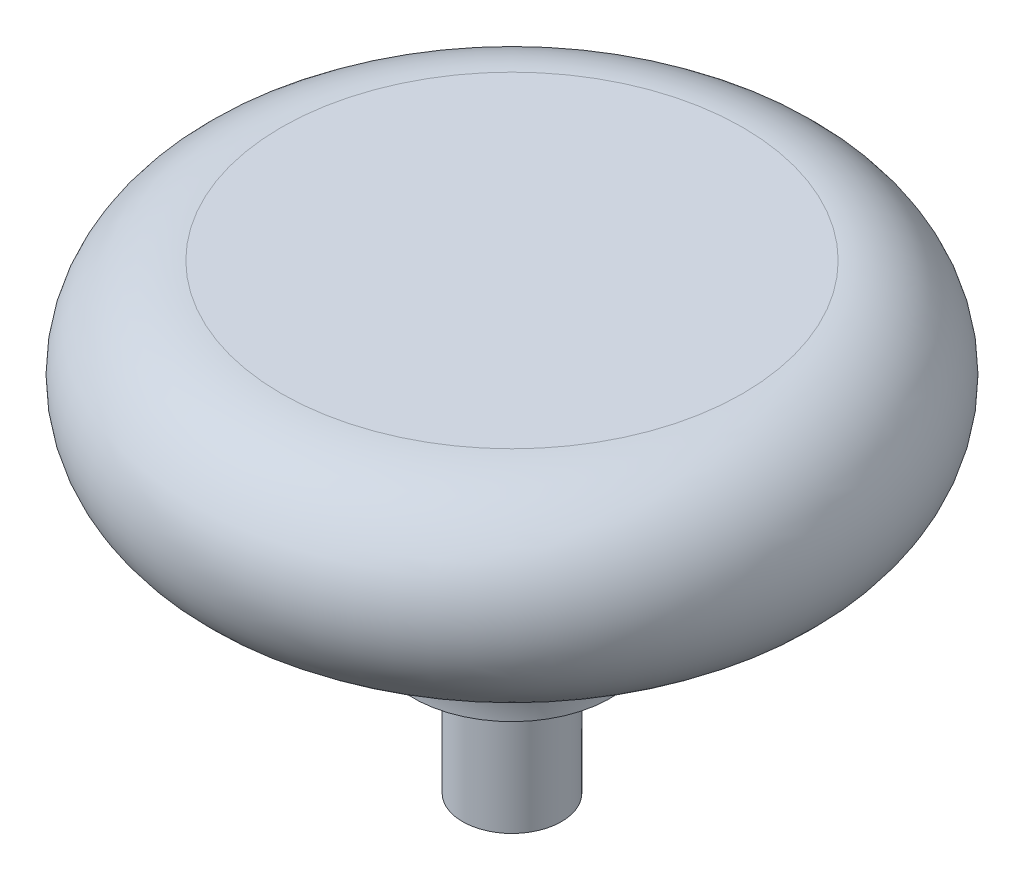
ISO-10303-21;
HEADER;
FILE_DESCRIPTION(('STEP AP214'),'2;1');
FILE_NAME('part.step','',(''),(''),'','','');
FILE_SCHEMA(('AUTOMOTIVE_DESIGN { 1 0 10303 214 1 1 1 1 }'));
ENDSEC;
DATA;
#1=APPLICATION_CONTEXT('core data for automotive mechanical design processes');
#2=APPLICATION_PROTOCOL_DEFINITION('international standard','automotive_design',2000,#1);
#3=PRODUCT_CONTEXT('',#1,'mechanical');
#4=PRODUCT('Part','Part','',(#3));
#5=PRODUCT_RELATED_PRODUCT_CATEGORY('part','',(#4));
#6=PRODUCT_DEFINITION_FORMATION('','',#4);
#7=PRODUCT_DEFINITION_CONTEXT('part definition',#1,'design');
#8=PRODUCT_DEFINITION('design','',#6,#7);
#9=PRODUCT_DEFINITION_SHAPE('','',#8);
#10=(LENGTH_UNIT() NAMED_UNIT(*) SI_UNIT(.MILLI.,.METRE.));
#11=(NAMED_UNIT(*) PLANE_ANGLE_UNIT() SI_UNIT($,.RADIAN.));
#12=(NAMED_UNIT(*) SI_UNIT($,.STERADIAN.) SOLID_ANGLE_UNIT());
#13=UNCERTAINTY_MEASURE_WITH_UNIT(LENGTH_MEASURE(1.E-05),#10,'distance_accuracy_value','');
#14=(GEOMETRIC_REPRESENTATION_CONTEXT(3) GLOBAL_UNCERTAINTY_ASSIGNED_CONTEXT((#13)) GLOBAL_UNIT_ASSIGNED_CONTEXT((#10,
#11,#12)) REPRESENTATION_CONTEXT('',''));
#15=CARTESIAN_POINT('',(0.,0.,0.));
#16=DIRECTION('',(0.,0.,1.));
#17=DIRECTION('',(1.,0.,0.));
#18=AXIS2_PLACEMENT_3D('',#15,#16,#17);
#19=CARTESIAN_POINT('',(2.38125,0.,0.));
#20=DIRECTION('',(0.,1.,0.));
#21=DIRECTION('',(0.,0.,1.));
#22=AXIS2_PLACEMENT_3D('',#19,#20,#21);
#23=PLANE('',#22);
#24=CARTESIAN_POINT('',(0.,0.,0.));
#25=DIRECTION('',(0.,-1.,0.));
#26=DIRECTION('',(0.,0.,-1.));
#27=AXIS2_PLACEMENT_3D('',#24,#25,#26);
#28=CIRCLE('',#27,2.38125);
#29=CARTESIAN_POINT('',(0.,0.,-2.38125));
#30=VERTEX_POINT('',#29);
#31=EDGE_CURVE('E53',#30,#30,#28,.T.);
#32=ORIENTED_EDGE('',*,*,#31,.T.);
#33=EDGE_LOOP('',(#32));
#34=FACE_BOUND('',#33,.T.);
#35=ADVANCED_FACE('F34',(#34),#23,.F.);
#36=CARTESIAN_POINT('',(0.,22.225,0.));
#37=DIRECTION('',(0.,-1.,0.));
#38=DIRECTION('',(0.,0.,-1.));
#39=AXIS2_PLACEMENT_3D('',#36,#37,#38);
#40=PLANE('',#39);
#41=CARTESIAN_POINT('',(0.,22.225,0.));
#42=DIRECTION('',(0.,-1.,0.));
#43=DIRECTION('',(0.,0.,-1.));
#44=AXIS2_PLACEMENT_3D('',#41,#42,#43);
#45=CIRCLE('',#44,11.1125);
#46=CARTESIAN_POINT('',(0.,22.225,-11.1125));
#47=VERTEX_POINT('',#46);
#48=EDGE_CURVE('E10',#47,#47,#45,.T.);
#49=ORIENTED_EDGE('',*,*,#48,.F.);
#50=EDGE_LOOP('',(#49));
#51=FACE_BOUND('',#50,.T.);
#52=ADVANCED_FACE('F77',(#51),#40,.F.);
#53=CARTESIAN_POINT('',(0.,17.4625,0.));
#54=DIRECTION('',(0.,-1.,0.));
#55=DIRECTION('',(0.,0.,-1.));
#56=AXIS2_PLACEMENT_3D('',#53,#54,#55);
#57=TOROIDAL_SURFACE('',#56,11.1125,4.7625);
#58=CARTESIAN_POINT('',(0.,12.7,0.));
#59=DIRECTION('',(0.,-1.,0.));
#60=DIRECTION('',(0.,0.,-1.));
#61=AXIS2_PLACEMENT_3D('',#58,#59,#60);
#62=CIRCLE('',#61,11.1125);
#63=CARTESIAN_POINT('',(0.,12.7,-11.1125));
#64=VERTEX_POINT('',#63);
#65=EDGE_CURVE('E40',#64,#64,#62,.T.);
#66=ORIENTED_EDGE('',*,*,#65,.F.);
#67=EDGE_LOOP('',(#66));
#68=FACE_BOUND('',#67,.T.);
#69=ORIENTED_EDGE('',*,*,#48,.T.);
#70=EDGE_LOOP('',(#69));
#71=FACE_BOUND('',#70,.T.);
#72=ADVANCED_FACE('F72',(#68,#71),#57,.T.);
#73=CARTESIAN_POINT('',(0.,6.35,0.));
#74=DIRECTION('',(0.,-1.,0.));
#75=DIRECTION('',(0.,0.,-1.));
#76=AXIS2_PLACEMENT_3D('',#73,#74,#75);
#77=TOROIDAL_SURFACE('',#76,11.1125,6.35);
#78=CARTESIAN_POINT('',(0.,6.35,0.));
#79=DIRECTION('',(0.,-1.,0.));
#80=DIRECTION('',(0.,0.,-1.));
#81=AXIS2_PLACEMENT_3D('',#78,#79,#80);
#82=CIRCLE('',#81,4.7625);
#83=CARTESIAN_POINT('',(0.,6.35,-4.7625));
#84=VERTEX_POINT('',#83);
#85=EDGE_CURVE('E44',#84,#84,#82,.T.);
#86=ORIENTED_EDGE('',*,*,#85,.F.);
#87=EDGE_LOOP('',(#86));
#88=FACE_BOUND('',#87,.T.);
#89=ORIENTED_EDGE('',*,*,#65,.T.);
#90=EDGE_LOOP('',(#89));
#91=FACE_BOUND('',#90,.T.);
#92=ADVANCED_FACE('F67',(#88,#91),#77,.F.);
#93=CARTESIAN_POINT('',(4.7625,6.35,0.));
#94=DIRECTION('',(0.,1.,0.));
#95=DIRECTION('',(0.,0.,1.));
#96=AXIS2_PLACEMENT_3D('',#93,#94,#95);
#97=PLANE('',#96);
#98=CARTESIAN_POINT('',(0.,6.35,0.));
#99=DIRECTION('',(0.,-1.,0.));
#100=DIRECTION('',(0.,0.,-1.));
#101=AXIS2_PLACEMENT_3D('',#98,#99,#100);
#102=CIRCLE('',#101,2.38125);
#103=CARTESIAN_POINT('',(0.,6.35,-2.38125));
#104=VERTEX_POINT('',#103);
#105=EDGE_CURVE('E48',#104,#104,#102,.T.);
#106=ORIENTED_EDGE('',*,*,#105,.F.);
#107=EDGE_LOOP('',(#106));
#108=FACE_BOUND('',#107,.T.);
#109=ORIENTED_EDGE('',*,*,#85,.T.);
#110=EDGE_LOOP('',(#109));
#111=FACE_BOUND('',#110,.T.);
#112=ADVANCED_FACE('F61',(#108,#111),#97,.F.);
#113=CARTESIAN_POINT('',(0.,0.,0.));
#114=DIRECTION('',(0.,-1.,0.));
#115=DIRECTION('',(0.,0.,-1.));
#116=AXIS2_PLACEMENT_3D('',#113,#114,#115);
#117=CYLINDRICAL_SURFACE('',#116,2.38125);
#118=ORIENTED_EDGE('',*,*,#31,.F.);
#119=EDGE_LOOP('',(#118));
#120=FACE_BOUND('',#119,.T.);
#121=ORIENTED_EDGE('',*,*,#105,.T.);
#122=EDGE_LOOP('',(#121));
#123=FACE_BOUND('',#122,.T.);
#124=ADVANCED_FACE('F58',(#120,#123),#117,.T.);
#125=CLOSED_SHELL('',(#35,#52,#72,#92,#112,#124));
#126=MANIFOLD_SOLID_BREP('B2',#125);
#127=ADVANCED_BREP_SHAPE_REPRESENTATION('',(#18,#126),#14);
#128=SHAPE_DEFINITION_REPRESENTATION(#9,#127);
ENDSEC;
END-ISO-10303-21;
